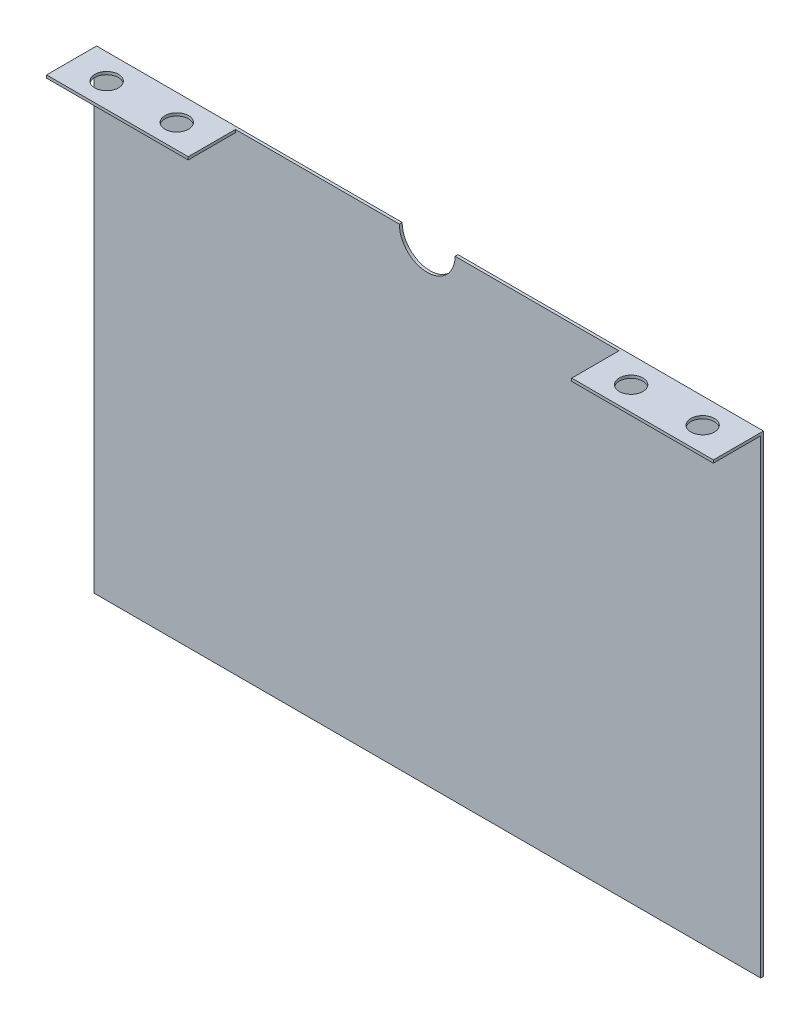
ISO-10303-21;
HEADER;
FILE_DESCRIPTION(('STEP AP214'),'2;1');
FILE_NAME('part.step','',(''),(''),'','','');
FILE_SCHEMA(('AUTOMOTIVE_DESIGN { 1 0 10303 214 1 1 1 1 }'));
ENDSEC;
DATA;
#1=APPLICATION_CONTEXT('core data for automotive mechanical design processes');
#2=APPLICATION_PROTOCOL_DEFINITION('international standard','automotive_design',2000,#1);
#3=PRODUCT_CONTEXT('',#1,'mechanical');
#4=PRODUCT('Part','Part','',(#3));
#5=PRODUCT_RELATED_PRODUCT_CATEGORY('part','',(#4));
#6=PRODUCT_DEFINITION_FORMATION('','',#4);
#7=PRODUCT_DEFINITION_CONTEXT('part definition',#1,'design');
#8=PRODUCT_DEFINITION('design','',#6,#7);
#9=PRODUCT_DEFINITION_SHAPE('','',#8);
#10=(LENGTH_UNIT() NAMED_UNIT(*) SI_UNIT(.MILLI.,.METRE.));
#11=(NAMED_UNIT(*) PLANE_ANGLE_UNIT() SI_UNIT($,.RADIAN.));
#12=(NAMED_UNIT(*) SI_UNIT($,.STERADIAN.) SOLID_ANGLE_UNIT());
#13=UNCERTAINTY_MEASURE_WITH_UNIT(LENGTH_MEASURE(1.E-05),#10,'distance_accuracy_value','');
#14=(GEOMETRIC_REPRESENTATION_CONTEXT(3) GLOBAL_UNCERTAINTY_ASSIGNED_CONTEXT((#13)) GLOBAL_UNIT_ASSIGNED_CONTEXT((#10,
#11,#12)) REPRESENTATION_CONTEXT('',''));
#15=CARTESIAN_POINT('',(0.,0.,0.));
#16=DIRECTION('',(0.,0.,1.));
#17=DIRECTION('',(1.,0.,0.));
#18=AXIS2_PLACEMENT_3D('',#15,#16,#17);
#19=CARTESIAN_POINT('',(0.,177.8,1.51892));
#20=DIRECTION('',(0.,0.,-1.));
#21=DIRECTION('',(-1.,0.,0.));
#22=AXIS2_PLACEMENT_3D('',#19,#20,#21);
#23=PLANE('',#22);
#24=DIRECTION('',(0.,-1.,0.));
#25=VECTOR('',#24,1.);
#26=CARTESIAN_POINT('',(103.11892,177.8,1.51892));
#27=LINE('',#26,#25);
#28=CARTESIAN_POINT('',(103.11892,177.8,1.51892));
#29=VERTEX_POINT('',#28);
#30=CARTESIAN_POINT('',(103.11892,176.28108,1.51892));
#31=VERTEX_POINT('',#30);
#32=EDGE_CURVE('E153',#29,#31,#27,.T.);
#33=ORIENTED_EDGE('',*,*,#32,.F.);
#34=DIRECTION('',(-1.,0.,0.));
#35=VECTOR('',#34,1.);
#36=CARTESIAN_POINT('',(15.,177.8,1.51892));
#37=LINE('',#36,#35);
#38=CARTESIAN_POINT('',(15.,177.8,1.51892));
#39=VERTEX_POINT('',#38);
#40=EDGE_CURVE('E200',#29,#39,#37,.T.);
#41=ORIENTED_EDGE('',*,*,#40,.T.);
#42=CARTESIAN_POINT('',(0.,177.8,1.51892));
#43=DIRECTION('',(0.,0.,-1.));
#44=DIRECTION('',(-1.,0.,0.));
#45=AXIS2_PLACEMENT_3D('',#42,#43,#44);
#46=CIRCLE('',#45,15.);
#47=CARTESIAN_POINT('',(-15.,177.8,1.51892));
#48=VERTEX_POINT('',#47);
#49=EDGE_CURVE('E202',#39,#48,#46,.T.);
#50=ORIENTED_EDGE('',*,*,#49,.T.);
#51=DIRECTION('',(-1.,0.,0.));
#52=VECTOR('',#51,1.);
#53=CARTESIAN_POINT('',(-179.31892,177.8,1.51892));
#54=LINE('',#53,#52);
#55=CARTESIAN_POINT('',(-103.11892,177.8,1.51892));
#56=VERTEX_POINT('',#55);
#57=EDGE_CURVE('E204',#48,#56,#54,.T.);
#58=ORIENTED_EDGE('',*,*,#57,.T.);
#59=DIRECTION('',(0.,1.,0.));
#60=VECTOR('',#59,1.);
#61=CARTESIAN_POINT('',(-103.11892,177.8,1.51892));
#62=LINE('',#61,#60);
#63=CARTESIAN_POINT('',(-103.11892,176.28108,1.51892));
#64=VERTEX_POINT('',#63);
#65=EDGE_CURVE('E173',#64,#56,#62,.T.);
#66=ORIENTED_EDGE('',*,*,#65,.F.);
#67=DIRECTION('',(1.,0.,0.));
#68=VECTOR('',#67,1.);
#69=CARTESIAN_POINT('',(-179.31892,176.28108,1.51892));
#70=LINE('',#69,#68);
#71=CARTESIAN_POINT('',(-179.31892,176.28108,1.51892));
#72=VERTEX_POINT('',#71);
#73=EDGE_CURVE('E168',#72,#64,#70,.T.);
#74=ORIENTED_EDGE('',*,*,#73,.F.);
#75=DIRECTION('',(0.,-1.,0.));
#76=VECTOR('',#75,1.);
#77=CARTESIAN_POINT('',(-179.31892,177.8,1.51892));
#78=LINE('',#77,#76);
#79=CARTESIAN_POINT('',(-179.31892,-76.2,1.51892));
#80=VERTEX_POINT('',#79);
#81=EDGE_CURVE('E194',#72,#80,#78,.T.);
#82=ORIENTED_EDGE('',*,*,#81,.T.);
#83=DIRECTION('',(1.,0.,0.));
#84=VECTOR('',#83,1.);
#85=CARTESIAN_POINT('',(-179.31892,-76.2,1.51892));
#86=LINE('',#85,#84);
#87=CARTESIAN_POINT('',(179.31892,-76.2,1.51892));
#88=VERTEX_POINT('',#87);
#89=EDGE_CURVE('E196',#80,#88,#86,.T.);
#90=ORIENTED_EDGE('',*,*,#89,.T.);
#91=DIRECTION('',(0.,1.,0.));
#92=VECTOR('',#91,1.);
#93=CARTESIAN_POINT('',(179.31892,177.8,1.51892));
#94=LINE('',#93,#92);
#95=CARTESIAN_POINT('',(179.31892,176.28108,1.51892));
#96=VERTEX_POINT('',#95);
#97=EDGE_CURVE('E58',#88,#96,#94,.T.);
#98=ORIENTED_EDGE('',*,*,#97,.T.);
#99=DIRECTION('',(1.,0.,0.));
#100=VECTOR('',#99,1.);
#101=CARTESIAN_POINT('',(179.31892,176.28108,1.51892));
#102=LINE('',#101,#100);
#103=EDGE_CURVE('E53',#31,#96,#102,.T.);
#104=ORIENTED_EDGE('',*,*,#103,.F.);
#105=EDGE_LOOP('',(#33,#41,#50,#58,#66,#74,#82,#90,#98,#104));
#106=FACE_BOUND('',#105,.T.);
#107=ADVANCED_FACE('F36',(#106),#23,.F.);
#108=CARTESIAN_POINT('',(-179.31892,177.8,1.51892));
#109=DIRECTION('',(1.,0.,0.));
#110=DIRECTION('',(0.,1.,0.));
#111=AXIS2_PLACEMENT_3D('',#108,#109,#110);
#112=PLANE('',#111);
#113=DIRECTION('',(0.,-1.,0.));
#114=VECTOR('',#113,1.);
#115=CARTESIAN_POINT('',(-179.31892,177.8,0.));
#116=LINE('',#115,#114);
#117=CARTESIAN_POINT('',(-179.31892,177.8,0.));
#118=VERTEX_POINT('',#117);
#119=CARTESIAN_POINT('',(-179.31892,-76.2,0.));
#120=VERTEX_POINT('',#119);
#121=EDGE_CURVE('E193',#118,#120,#116,.T.);
#122=ORIENTED_EDGE('',*,*,#121,.T.);
#123=DIRECTION('',(0.,0.,-1.));
#124=VECTOR('',#123,1.);
#125=CARTESIAN_POINT('',(-179.31892,-76.2,1.51892));
#126=LINE('',#125,#124);
#127=EDGE_CURVE('E11',#80,#120,#126,.T.);
#128=ORIENTED_EDGE('',*,*,#127,.F.);
#129=ORIENTED_EDGE('',*,*,#81,.F.);
#130=DIRECTION('',(0.,0.,-1.));
#131=VECTOR('',#130,1.);
#132=CARTESIAN_POINT('',(-179.31892,176.28108,26.91892));
#133=LINE('',#132,#131);
#134=CARTESIAN_POINT('',(-179.31892,176.28108,26.91892));
#135=VERTEX_POINT('',#134);
#136=EDGE_CURVE('E190',#135,#72,#133,.T.);
#137=ORIENTED_EDGE('',*,*,#136,.F.);
#138=DIRECTION('',(0.,-1.,0.));
#139=VECTOR('',#138,1.);
#140=CARTESIAN_POINT('',(-179.31892,177.8,26.91892));
#141=LINE('',#140,#139);
#142=CARTESIAN_POINT('',(-179.31892,177.8,26.91892));
#143=VERTEX_POINT('',#142);
#144=EDGE_CURVE('E169',#143,#135,#141,.T.);
#145=ORIENTED_EDGE('',*,*,#144,.F.);
#146=DIRECTION('',(0.,0.,-1.));
#147=VECTOR('',#146,1.);
#148=CARTESIAN_POINT('',(-179.31892,177.8,1.51892));
#149=LINE('',#148,#147);
#150=EDGE_CURVE('E206',#143,#118,#149,.T.);
#151=ORIENTED_EDGE('',*,*,#150,.T.);
#152=EDGE_LOOP('',(#122,#128,#129,#137,#145,#151));
#153=FACE_BOUND('',#152,.T.);
#154=ADVANCED_FACE('F38',(#153),#112,.F.);
#155=CARTESIAN_POINT('',(-179.31892,-76.2,1.51892));
#156=DIRECTION('',(0.,1.,0.));
#157=DIRECTION('',(-1.,0.,0.));
#158=AXIS2_PLACEMENT_3D('',#155,#156,#157);
#159=PLANE('',#158);
#160=DIRECTION('',(1.,0.,0.));
#161=VECTOR('',#160,1.);
#162=CARTESIAN_POINT('',(-179.31892,-76.2,0.));
#163=LINE('',#162,#161);
#164=CARTESIAN_POINT('',(179.31892,-76.2,0.));
#165=VERTEX_POINT('',#164);
#166=EDGE_CURVE('E209',#120,#165,#163,.T.);
#167=ORIENTED_EDGE('',*,*,#166,.T.);
#168=DIRECTION('',(0.,0.,-1.));
#169=VECTOR('',#168,1.);
#170=CARTESIAN_POINT('',(179.31892,-76.2,1.51892));
#171=LINE('',#170,#169);
#172=EDGE_CURVE('E45',#88,#165,#171,.T.);
#173=ORIENTED_EDGE('',*,*,#172,.F.);
#174=ORIENTED_EDGE('',*,*,#89,.F.);
#175=ORIENTED_EDGE('',*,*,#127,.T.);
#176=EDGE_LOOP('',(#167,#173,#174,#175));
#177=FACE_BOUND('',#176,.T.);
#178=ADVANCED_FACE('F257',(#177),#159,.F.);
#179=CARTESIAN_POINT('',(179.31892,177.8,1.51892));
#180=DIRECTION('',(-1.,0.,0.));
#181=DIRECTION('',(0.,-1.,0.));
#182=AXIS2_PLACEMENT_3D('',#179,#180,#181);
#183=PLANE('',#182);
#184=DIRECTION('',(0.,1.,0.));
#185=VECTOR('',#184,1.);
#186=CARTESIAN_POINT('',(179.31892,177.8,0.));
#187=LINE('',#186,#185);
#188=CARTESIAN_POINT('',(179.31892,177.8,0.));
#189=VERTEX_POINT('',#188);
#190=EDGE_CURVE('E134',#165,#189,#187,.T.);
#191=ORIENTED_EDGE('',*,*,#190,.T.);
#192=DIRECTION('',(0.,0.,-1.));
#193=VECTOR('',#192,1.);
#194=CARTESIAN_POINT('',(179.31892,177.8,1.51892));
#195=LINE('',#194,#193);
#196=CARTESIAN_POINT('',(179.31892,177.8,26.91892));
#197=VERTEX_POINT('',#196);
#198=EDGE_CURVE('E126',#197,#189,#195,.T.);
#199=ORIENTED_EDGE('',*,*,#198,.F.);
#200=DIRECTION('',(0.,1.,0.));
#201=VECTOR('',#200,1.);
#202=CARTESIAN_POINT('',(179.31892,177.8,26.91892));
#203=LINE('',#202,#201);
#204=CARTESIAN_POINT('',(179.31892,176.28108,26.91892));
#205=VERTEX_POINT('',#204);
#206=EDGE_CURVE('E131',#205,#197,#203,.T.);
#207=ORIENTED_EDGE('',*,*,#206,.F.);
#208=DIRECTION('',(0.,0.,-1.));
#209=VECTOR('',#208,1.);
#210=CARTESIAN_POINT('',(179.31892,176.28108,26.91892));
#211=LINE('',#210,#209);
#212=EDGE_CURVE('E161',#205,#96,#211,.T.);
#213=ORIENTED_EDGE('',*,*,#212,.T.);
#214=ORIENTED_EDGE('',*,*,#97,.F.);
#215=ORIENTED_EDGE('',*,*,#172,.T.);
#216=EDGE_LOOP('',(#191,#199,#207,#213,#214,#215));
#217=FACE_BOUND('',#216,.T.);
#218=ADVANCED_FACE('F128',(#217),#183,.F.);
#219=CARTESIAN_POINT('',(15.,177.8,1.51892));
#220=DIRECTION('',(0.,-1.,0.));
#221=DIRECTION('',(1.,0.,0.));
#222=AXIS2_PLACEMENT_3D('',#219,#220,#221);
#223=PLANE('',#222);
#224=CARTESIAN_POINT('',(122.16892,177.8,14.029055));
#225=DIRECTION('',(0.,1.,0.));
#226=DIRECTION('',(0.,0.,-1.));
#227=AXIS2_PLACEMENT_3D('',#224,#225,#226);
#228=CIRCLE('',#227,6.35);
#229=CARTESIAN_POINT('',(122.16892,177.8,7.67905500000001));
#230=VERTEX_POINT('',#229);
#231=EDGE_CURVE('E411',#230,#230,#228,.T.);
#232=ORIENTED_EDGE('',*,*,#231,.F.);
#233=EDGE_LOOP('',(#232));
#234=FACE_BOUND('',#233,.T.);
#235=CARTESIAN_POINT('',(160.26892,177.8,13.649325));
#236=DIRECTION('',(0.,1.,0.));
#237=DIRECTION('',(0.,0.,-1.));
#238=AXIS2_PLACEMENT_3D('',#235,#236,#237);
#239=CIRCLE('',#238,6.35);
#240=CARTESIAN_POINT('',(160.26892,177.8,7.299325));
#241=VERTEX_POINT('',#240);
#242=EDGE_CURVE('E156',#241,#241,#239,.T.);
#243=ORIENTED_EDGE('',*,*,#242,.F.);
#244=EDGE_LOOP('',(#243));
#245=FACE_BOUND('',#244,.T.);
#246=DIRECTION('',(-1.,0.,0.));
#247=VECTOR('',#246,1.);
#248=CARTESIAN_POINT('',(15.,177.8,0.));
#249=LINE('',#248,#247);
#250=CARTESIAN_POINT('',(15.,177.8,0.));
#251=VERTEX_POINT('',#250);
#252=EDGE_CURVE('E212',#189,#251,#249,.T.);
#253=ORIENTED_EDGE('',*,*,#252,.T.);
#254=DIRECTION('',(0.,0.,-1.));
#255=VECTOR('',#254,1.);
#256=CARTESIAN_POINT('',(15.,177.8,1.51892));
#257=LINE('',#256,#255);
#258=EDGE_CURVE('E137',#39,#251,#257,.T.);
#259=ORIENTED_EDGE('',*,*,#258,.F.);
#260=ORIENTED_EDGE('',*,*,#40,.F.);
#261=DIRECTION('',(0.,0.,-1.));
#262=VECTOR('',#261,1.);
#263=CARTESIAN_POINT('',(103.11892,177.8,26.91892));
#264=LINE('',#263,#262);
#265=CARTESIAN_POINT('',(103.11892,177.8,26.91892));
#266=VERTEX_POINT('',#265);
#267=EDGE_CURVE('E143',#266,#29,#264,.T.);
#268=ORIENTED_EDGE('',*,*,#267,.F.);
#269=DIRECTION('',(-1.,0.,0.));
#270=VECTOR('',#269,1.);
#271=CARTESIAN_POINT('',(179.31892,177.8,26.91892));
#272=LINE('',#271,#270);
#273=EDGE_CURVE('E140',#197,#266,#272,.T.);
#274=ORIENTED_EDGE('',*,*,#273,.F.);
#275=ORIENTED_EDGE('',*,*,#198,.T.);
#276=EDGE_LOOP('',(#253,#259,#260,#268,#274,#275));
#277=FACE_BOUND('',#276,.T.);
#278=ADVANCED_FACE('F141',(#234,#245,#277),#223,.F.);
#279=CARTESIAN_POINT('',(0.,177.8,1.51892));
#280=DIRECTION('',(0.,0.,-1.));
#281=DIRECTION('',(-1.,0.,0.));
#282=AXIS2_PLACEMENT_3D('',#279,#280,#281);
#283=CYLINDRICAL_SURFACE('',#282,15.);
#284=CARTESIAN_POINT('',(0.,177.8,0.));
#285=DIRECTION('',(0.,0.,-1.));
#286=DIRECTION('',(-1.,0.,0.));
#287=AXIS2_PLACEMENT_3D('',#284,#285,#286);
#288=CIRCLE('',#287,15.);
#289=CARTESIAN_POINT('',(-15.,177.8,0.));
#290=VERTEX_POINT('',#289);
#291=EDGE_CURVE('E214',#251,#290,#288,.T.);
#292=ORIENTED_EDGE('',*,*,#291,.T.);
#293=DIRECTION('',(0.,0.,-1.));
#294=VECTOR('',#293,1.);
#295=CARTESIAN_POINT('',(-15.,177.8,1.51892));
#296=LINE('',#295,#294);
#297=EDGE_CURVE('E219',#48,#290,#296,.T.);
#298=ORIENTED_EDGE('',*,*,#297,.F.);
#299=ORIENTED_EDGE('',*,*,#49,.F.);
#300=ORIENTED_EDGE('',*,*,#258,.T.);
#301=EDGE_LOOP('',(#292,#298,#299,#300));
#302=FACE_BOUND('',#301,.T.);
#303=ADVANCED_FACE('F269',(#302),#283,.F.);
#304=CARTESIAN_POINT('',(-179.31892,177.8,1.51892));
#305=DIRECTION('',(0.,-1.,0.));
#306=DIRECTION('',(0.,0.,-1.));
#307=AXIS2_PLACEMENT_3D('',#304,#305,#306);
#308=PLANE('',#307);
#309=CARTESIAN_POINT('',(-160.26892,177.8,13.649325));
#310=DIRECTION('',(0.,1.,0.));
#311=DIRECTION('',(0.,0.,1.));
#312=AXIS2_PLACEMENT_3D('',#309,#310,#311);
#313=CIRCLE('',#312,6.35);
#314=CARTESIAN_POINT('',(-160.26892,177.8,19.999325));
#315=VERTEX_POINT('',#314);
#316=EDGE_CURVE('E229',#315,#315,#313,.T.);
#317=ORIENTED_EDGE('',*,*,#316,.F.);
#318=EDGE_LOOP('',(#317));
#319=FACE_BOUND('',#318,.T.);
#320=CARTESIAN_POINT('',(-122.16892,177.8,14.029055));
#321=DIRECTION('',(0.,1.,0.));
#322=DIRECTION('',(0.,0.,1.));
#323=AXIS2_PLACEMENT_3D('',#320,#321,#322);
#324=CIRCLE('',#323,6.35);
#325=CARTESIAN_POINT('',(-122.16892,177.8,20.379055));
#326=VERTEX_POINT('',#325);
#327=EDGE_CURVE('E413',#326,#326,#324,.T.);
#328=ORIENTED_EDGE('',*,*,#327,.F.);
#329=EDGE_LOOP('',(#328));
#330=FACE_BOUND('',#329,.T.);
#331=DIRECTION('',(-1.,0.,0.));
#332=VECTOR('',#331,1.);
#333=CARTESIAN_POINT('',(-179.31892,177.8,0.));
#334=LINE('',#333,#332);
#335=EDGE_CURVE('E197',#290,#118,#334,.T.);
#336=ORIENTED_EDGE('',*,*,#335,.T.);
#337=ORIENTED_EDGE('',*,*,#150,.F.);
#338=DIRECTION('',(-1.,0.,0.));
#339=VECTOR('',#338,1.);
#340=CARTESIAN_POINT('',(-179.31892,177.8,26.91892));
#341=LINE('',#340,#339);
#342=CARTESIAN_POINT('',(-103.11892,177.8,26.91892));
#343=VERTEX_POINT('',#342);
#344=EDGE_CURVE('E177',#343,#143,#341,.T.);
#345=ORIENTED_EDGE('',*,*,#344,.F.);
#346=DIRECTION('',(0.,0.,-1.));
#347=VECTOR('',#346,1.);
#348=CARTESIAN_POINT('',(-103.11892,177.8,26.91892));
#349=LINE('',#348,#347);
#350=EDGE_CURVE('E180',#343,#56,#349,.T.);
#351=ORIENTED_EDGE('',*,*,#350,.T.);
#352=ORIENTED_EDGE('',*,*,#57,.F.);
#353=ORIENTED_EDGE('',*,*,#297,.T.);
#354=EDGE_LOOP('',(#336,#337,#345,#351,#352,#353));
#355=FACE_BOUND('',#354,.T.);
#356=ADVANCED_FACE('F265',(#319,#330,#355),#308,.F.);
#357=CARTESIAN_POINT('',(0.,177.8,0.));
#358=DIRECTION('',(0.,0.,-1.));
#359=DIRECTION('',(-1.,0.,0.));
#360=AXIS2_PLACEMENT_3D('',#357,#358,#359);
#361=PLANE('',#360);
#362=ORIENTED_EDGE('',*,*,#121,.F.);
#363=ORIENTED_EDGE('',*,*,#335,.F.);
#364=ORIENTED_EDGE('',*,*,#291,.F.);
#365=ORIENTED_EDGE('',*,*,#252,.F.);
#366=ORIENTED_EDGE('',*,*,#190,.F.);
#367=ORIENTED_EDGE('',*,*,#166,.F.);
#368=EDGE_LOOP('',(#362,#363,#364,#365,#366,#367));
#369=FACE_BOUND('',#368,.T.);
#370=ADVANCED_FACE('F262',(#369),#361,.T.);
#371=CARTESIAN_POINT('',(-179.31892,176.28108,26.91892));
#372=DIRECTION('',(0.,1.,0.));
#373=DIRECTION('',(0.,0.,1.));
#374=AXIS2_PLACEMENT_3D('',#371,#372,#373);
#375=PLANE('',#374);
#376=CARTESIAN_POINT('',(-160.26892,176.28108,13.649325));
#377=DIRECTION('',(0.,1.,0.));
#378=DIRECTION('',(0.,0.,1.));
#379=AXIS2_PLACEMENT_3D('',#376,#377,#378);
#380=CIRCLE('',#379,6.35);
#381=CARTESIAN_POINT('',(-160.26892,176.28108,19.999325));
#382=VERTEX_POINT('',#381);
#383=EDGE_CURVE('E40',#382,#382,#380,.T.);
#384=ORIENTED_EDGE('',*,*,#383,.T.);
#385=EDGE_LOOP('',(#384));
#386=FACE_BOUND('',#385,.T.);
#387=CARTESIAN_POINT('',(-122.16892,176.28108,14.029055));
#388=DIRECTION('',(0.,1.,0.));
#389=DIRECTION('',(0.,0.,1.));
#390=AXIS2_PLACEMENT_3D('',#387,#388,#389);
#391=CIRCLE('',#390,6.35);
#392=CARTESIAN_POINT('',(-122.16892,176.28108,20.379055));
#393=VERTEX_POINT('',#392);
#394=EDGE_CURVE('E231',#393,#393,#391,.T.);
#395=ORIENTED_EDGE('',*,*,#394,.T.);
#396=EDGE_LOOP('',(#395));
#397=FACE_BOUND('',#396,.T.);
#398=ORIENTED_EDGE('',*,*,#73,.T.);
#399=DIRECTION('',(0.,0.,-1.));
#400=VECTOR('',#399,1.);
#401=CARTESIAN_POINT('',(-103.11892,176.28108,26.91892));
#402=LINE('',#401,#400);
#403=CARTESIAN_POINT('',(-103.11892,176.28108,26.91892));
#404=VERTEX_POINT('',#403);
#405=EDGE_CURVE('E187',#404,#64,#402,.T.);
#406=ORIENTED_EDGE('',*,*,#405,.F.);
#407=DIRECTION('',(1.,0.,0.));
#408=VECTOR('',#407,1.);
#409=CARTESIAN_POINT('',(-179.31892,176.28108,26.91892));
#410=LINE('',#409,#408);
#411=EDGE_CURVE('E172',#135,#404,#410,.T.);
#412=ORIENTED_EDGE('',*,*,#411,.F.);
#413=ORIENTED_EDGE('',*,*,#136,.T.);
#414=EDGE_LOOP('',(#398,#406,#412,#413));
#415=FACE_BOUND('',#414,.T.);
#416=ADVANCED_FACE('F238',(#386,#397,#415),#375,.F.);
#417=CARTESIAN_POINT('',(-103.11892,177.8,26.91892));
#418=DIRECTION('',(-1.,0.,0.));
#419=DIRECTION('',(0.,0.,1.));
#420=AXIS2_PLACEMENT_3D('',#417,#418,#419);
#421=PLANE('',#420);
#422=ORIENTED_EDGE('',*,*,#65,.T.);
#423=ORIENTED_EDGE('',*,*,#350,.F.);
#424=DIRECTION('',(0.,1.,0.));
#425=VECTOR('',#424,1.);
#426=CARTESIAN_POINT('',(-103.11892,177.8,26.91892));
#427=LINE('',#426,#425);
#428=EDGE_CURVE('E175',#404,#343,#427,.T.);
#429=ORIENTED_EDGE('',*,*,#428,.F.);
#430=ORIENTED_EDGE('',*,*,#405,.T.);
#431=EDGE_LOOP('',(#422,#423,#429,#430));
#432=FACE_BOUND('',#431,.T.);
#433=ADVANCED_FACE('F312',(#432),#421,.F.);
#434=CARTESIAN_POINT('',(0.,0.,26.91892));
#435=DIRECTION('',(0.,0.,1.));
#436=DIRECTION('',(1.,0.,0.));
#437=AXIS2_PLACEMENT_3D('',#434,#435,#436);
#438=PLANE('',#437);
#439=ORIENTED_EDGE('',*,*,#144,.T.);
#440=ORIENTED_EDGE('',*,*,#411,.T.);
#441=ORIENTED_EDGE('',*,*,#428,.T.);
#442=ORIENTED_EDGE('',*,*,#344,.T.);
#443=EDGE_LOOP('',(#439,#440,#441,#442));
#444=FACE_BOUND('',#443,.T.);
#445=ADVANCED_FACE('F306',(#444),#438,.T.);
#446=CARTESIAN_POINT('',(103.11892,177.8,26.91892));
#447=DIRECTION('',(1.,0.,0.));
#448=DIRECTION('',(0.,0.,-1.));
#449=AXIS2_PLACEMENT_3D('',#446,#447,#448);
#450=PLANE('',#449);
#451=ORIENTED_EDGE('',*,*,#32,.T.);
#452=DIRECTION('',(0.,0.,-1.));
#453=VECTOR('',#452,1.);
#454=CARTESIAN_POINT('',(103.11892,176.28108,26.91892));
#455=LINE('',#454,#453);
#456=CARTESIAN_POINT('',(103.11892,176.28108,26.91892));
#457=VERTEX_POINT('',#456);
#458=EDGE_CURVE('E164',#457,#31,#455,.T.);
#459=ORIENTED_EDGE('',*,*,#458,.F.);
#460=DIRECTION('',(0.,-1.,0.));
#461=VECTOR('',#460,1.);
#462=CARTESIAN_POINT('',(103.11892,177.8,26.91892));
#463=LINE('',#462,#461);
#464=EDGE_CURVE('E146',#266,#457,#463,.T.);
#465=ORIENTED_EDGE('',*,*,#464,.F.);
#466=ORIENTED_EDGE('',*,*,#267,.T.);
#467=EDGE_LOOP('',(#451,#459,#465,#466));
#468=FACE_BOUND('',#467,.T.);
#469=ADVANCED_FACE('F294',(#468),#450,.F.);
#470=CARTESIAN_POINT('',(179.31892,176.28108,26.91892));
#471=DIRECTION('',(0.,1.,0.));
#472=DIRECTION('',(0.,0.,1.));
#473=AXIS2_PLACEMENT_3D('',#470,#471,#472);
#474=PLANE('',#473);
#475=CARTESIAN_POINT('',(122.16892,176.28108,14.029055));
#476=DIRECTION('',(0.,1.,0.));
#477=DIRECTION('',(0.,0.,1.));
#478=AXIS2_PLACEMENT_3D('',#475,#476,#477);
#479=CIRCLE('',#478,6.35);
#480=CARTESIAN_POINT('',(122.16892,176.28108,20.379055));
#481=VERTEX_POINT('',#480);
#482=EDGE_CURVE('E228',#481,#481,#479,.T.);
#483=ORIENTED_EDGE('',*,*,#482,.T.);
#484=EDGE_LOOP('',(#483));
#485=FACE_BOUND('',#484,.T.);
#486=CARTESIAN_POINT('',(160.26892,176.28108,13.649325));
#487=DIRECTION('',(0.,1.,0.));
#488=DIRECTION('',(0.,0.,1.));
#489=AXIS2_PLACEMENT_3D('',#486,#487,#488);
#490=CIRCLE('',#489,6.35);
#491=CARTESIAN_POINT('',(160.26892,176.28108,19.999325));
#492=VERTEX_POINT('',#491);
#493=EDGE_CURVE('E225',#492,#492,#490,.T.);
#494=ORIENTED_EDGE('',*,*,#493,.T.);
#495=EDGE_LOOP('',(#494));
#496=FACE_BOUND('',#495,.T.);
#497=ORIENTED_EDGE('',*,*,#103,.T.);
#498=ORIENTED_EDGE('',*,*,#212,.F.);
#499=DIRECTION('',(1.,0.,0.));
#500=VECTOR('',#499,1.);
#501=CARTESIAN_POINT('',(179.31892,176.28108,26.91892));
#502=LINE('',#501,#500);
#503=EDGE_CURVE('E150',#457,#205,#502,.T.);
#504=ORIENTED_EDGE('',*,*,#503,.F.);
#505=ORIENTED_EDGE('',*,*,#458,.T.);
#506=EDGE_LOOP('',(#497,#498,#504,#505));
#507=FACE_BOUND('',#506,.T.);
#508=ADVANCED_FACE('F296',(#485,#496,#507),#474,.F.);
#509=CARTESIAN_POINT('',(0.,0.,26.91892));
#510=DIRECTION('',(0.,0.,-1.));
#511=DIRECTION('',(-1.,0.,0.));
#512=AXIS2_PLACEMENT_3D('',#509,#510,#511);
#513=PLANE('',#512);
#514=ORIENTED_EDGE('',*,*,#206,.T.);
#515=ORIENTED_EDGE('',*,*,#273,.T.);
#516=ORIENTED_EDGE('',*,*,#464,.T.);
#517=ORIENTED_EDGE('',*,*,#503,.T.);
#518=EDGE_LOOP('',(#514,#515,#516,#517));
#519=FACE_BOUND('',#518,.T.);
#520=ADVANCED_FACE('F148',(#519),#513,.F.);
#521=CARTESIAN_POINT('',(160.26892,152.4,13.649325));
#522=DIRECTION('',(0.,1.,0.));
#523=DIRECTION('',(0.,0.,1.));
#524=AXIS2_PLACEMENT_3D('',#521,#522,#523);
#525=CYLINDRICAL_SURFACE('',#524,6.35);
#526=ORIENTED_EDGE('',*,*,#242,.T.);
#527=EDGE_LOOP('',(#526));
#528=FACE_BOUND('',#527,.T.);
#529=ORIENTED_EDGE('',*,*,#493,.F.);
#530=EDGE_LOOP('',(#529));
#531=FACE_BOUND('',#530,.T.);
#532=ADVANCED_FACE('F304',(#528,#531),#525,.F.);
#533=CARTESIAN_POINT('',(122.16892,152.4,14.029055));
#534=DIRECTION('',(0.,1.,0.));
#535=DIRECTION('',(0.,0.,1.));
#536=AXIS2_PLACEMENT_3D('',#533,#534,#535);
#537=CYLINDRICAL_SURFACE('',#536,6.35);
#538=ORIENTED_EDGE('',*,*,#231,.T.);
#539=EDGE_LOOP('',(#538));
#540=FACE_BOUND('',#539,.T.);
#541=ORIENTED_EDGE('',*,*,#482,.F.);
#542=EDGE_LOOP('',(#541));
#543=FACE_BOUND('',#542,.T.);
#544=ADVANCED_FACE('F248',(#540,#543),#537,.F.);
#545=CARTESIAN_POINT('',(-122.16892,152.4,14.029055));
#546=DIRECTION('',(0.,1.,0.));
#547=DIRECTION('',(0.,0.,1.));
#548=AXIS2_PLACEMENT_3D('',#545,#546,#547);
#549=CYLINDRICAL_SURFACE('',#548,6.35);
#550=ORIENTED_EDGE('',*,*,#327,.T.);
#551=EDGE_LOOP('',(#550));
#552=FACE_BOUND('',#551,.T.);
#553=ORIENTED_EDGE('',*,*,#394,.F.);
#554=EDGE_LOOP('',(#553));
#555=FACE_BOUND('',#554,.T.);
#556=ADVANCED_FACE('F242',(#552,#555),#549,.F.);
#557=CARTESIAN_POINT('',(-160.26892,152.4,13.649325));
#558=DIRECTION('',(0.,1.,0.));
#559=DIRECTION('',(0.,0.,1.));
#560=AXIS2_PLACEMENT_3D('',#557,#558,#559);
#561=CYLINDRICAL_SURFACE('',#560,6.35);
#562=ORIENTED_EDGE('',*,*,#316,.T.);
#563=EDGE_LOOP('',(#562));
#564=FACE_BOUND('',#563,.T.);
#565=ORIENTED_EDGE('',*,*,#383,.F.);
#566=EDGE_LOOP('',(#565));
#567=FACE_BOUND('',#566,.T.);
#568=ADVANCED_FACE('F240',(#564,#567),#561,.F.);
#569=CLOSED_SHELL('',(#107,#154,#178,#218,#278,#303,#356,#370,#416,#433,#445,#469,#508,#520,
#532,#544,#556,#568));
#570=MANIFOLD_SOLID_BREP('B2',#569);
#571=ADVANCED_BREP_SHAPE_REPRESENTATION('',(#18,#570),#14);
#572=SHAPE_DEFINITION_REPRESENTATION(#9,#571);
ENDSEC;
END-ISO-10303-21;
